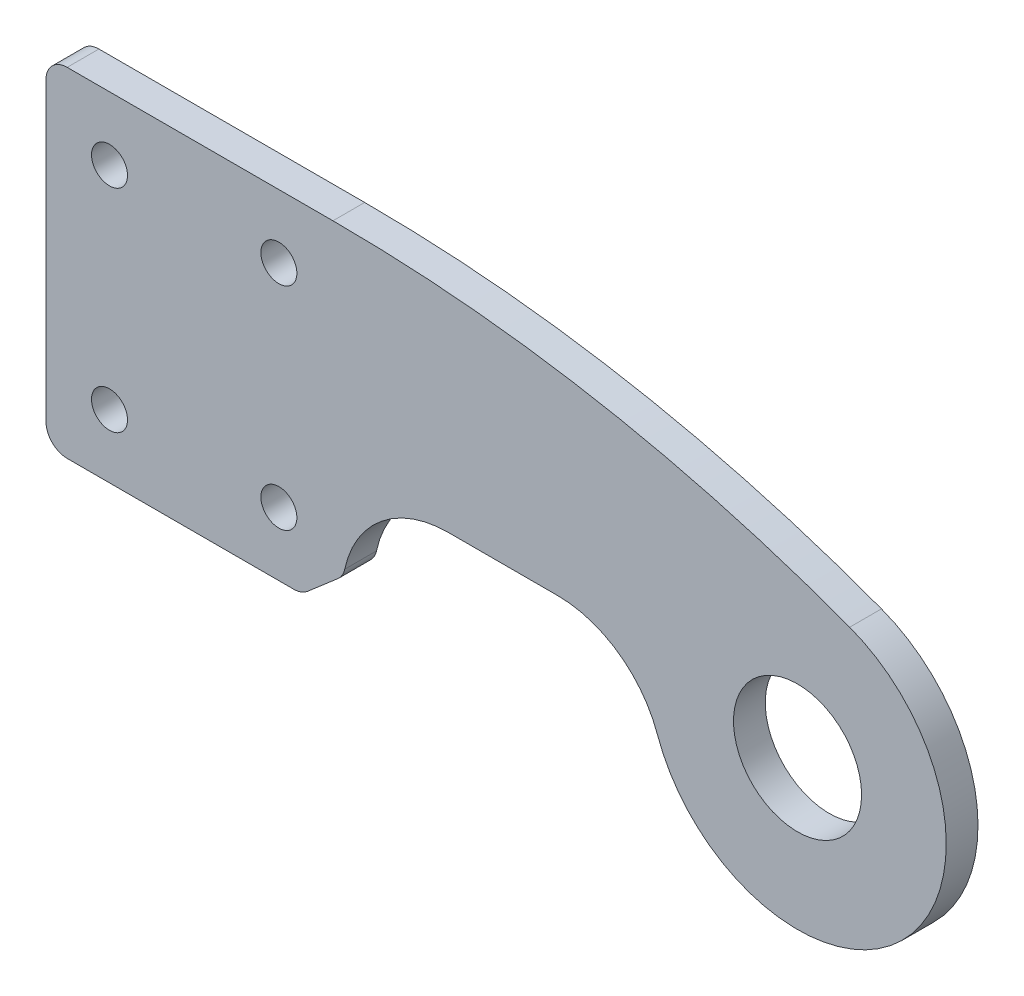
ISO-10303-21;
HEADER;
FILE_DESCRIPTION(('STEP AP214'),'2;1');
FILE_NAME('part.step','',(''),(''),'','','');
FILE_SCHEMA(('AUTOMOTIVE_DESIGN { 1 0 10303 214 1 1 1 1 }'));
ENDSEC;
DATA;
#1=APPLICATION_CONTEXT('core data for automotive mechanical design processes');
#2=APPLICATION_PROTOCOL_DEFINITION('international standard','automotive_design',2000,#1);
#3=PRODUCT_CONTEXT('',#1,'mechanical');
#4=PRODUCT('Part','Part','',(#3));
#5=PRODUCT_RELATED_PRODUCT_CATEGORY('part','',(#4));
#6=PRODUCT_DEFINITION_FORMATION('','',#4);
#7=PRODUCT_DEFINITION_CONTEXT('part definition',#1,'design');
#8=PRODUCT_DEFINITION('design','',#6,#7);
#9=PRODUCT_DEFINITION_SHAPE('','',#8);
#10=(LENGTH_UNIT() NAMED_UNIT(*) SI_UNIT(.MILLI.,.METRE.));
#11=(NAMED_UNIT(*) PLANE_ANGLE_UNIT() SI_UNIT($,.RADIAN.));
#12=(NAMED_UNIT(*) SI_UNIT($,.STERADIAN.) SOLID_ANGLE_UNIT());
#13=UNCERTAINTY_MEASURE_WITH_UNIT(LENGTH_MEASURE(1.E-05),#10,'distance_accuracy_value','');
#14=(GEOMETRIC_REPRESENTATION_CONTEXT(3) GLOBAL_UNCERTAINTY_ASSIGNED_CONTEXT((#13)) GLOBAL_UNIT_ASSIGNED_CONTEXT((#10,
#11,#12)) REPRESENTATION_CONTEXT('',''));
#15=CARTESIAN_POINT('',(0.,0.,0.));
#16=DIRECTION('',(0.,0.,1.));
#17=DIRECTION('',(1.,0.,0.));
#18=AXIS2_PLACEMENT_3D('',#15,#16,#17);
#19=CARTESIAN_POINT('',(0.,0.,0.75));
#20=DIRECTION('',(0.,0.,1.));
#21=DIRECTION('',(1.,0.,0.));
#22=AXIS2_PLACEMENT_3D('',#19,#20,#21);
#23=PLANE('',#22);
#24=CARTESIAN_POINT('',(0.,0.,0.75));
#25=DIRECTION('',(0.,0.,1.));
#26=DIRECTION('',(1.,0.,0.));
#27=AXIS2_PLACEMENT_3D('',#24,#25,#26);
#28=CIRCLE('',#27,7.025);
#29=CARTESIAN_POINT('',(-6.61978303243992,-2.35140332640333,0.75));
#30=VERTEX_POINT('',#29);
#31=CARTESIAN_POINT('',(2.46403607621132,6.57868917149374,0.75));
#32=VERTEX_POINT('',#31);
#33=EDGE_CURVE('E148',#30,#32,#28,.T.);
#34=ORIENTED_EDGE('',*,*,#33,.T.);
#35=CARTESIAN_POINT('',(-21.9455652369475,-58.5921017068076,0.75));
#36=DIRECTION('',(0.,0.,1.));
#37=DIRECTION('',(-1.,0.,0.));
#38=AXIS2_PLACEMENT_3D('',#35,#36,#37);
#39=CIRCLE('',#38,69.5921017068076);
#40=CARTESIAN_POINT('',(-21.9455652369475,11.,0.75));
#41=VERTEX_POINT('',#40);
#42=EDGE_CURVE('E132',#32,#41,#39,.T.);
#43=ORIENTED_EDGE('',*,*,#42,.T.);
#44=DIRECTION('',(-1.,0.,0.));
#45=VECTOR('',#44,1.);
#46=CARTESIAN_POINT('',(-35.5,11.,0.75));
#47=LINE('',#46,#45);
#48=CARTESIAN_POINT('',(-34.5,11.,0.75));
#49=VERTEX_POINT('',#48);
#50=EDGE_CURVE('E140',#41,#49,#47,.T.);
#51=ORIENTED_EDGE('',*,*,#50,.T.);
#52=CARTESIAN_POINT('',(-34.5,10.,0.75));
#53=DIRECTION('',(0.,0.,1.));
#54=DIRECTION('',(1.,0.,0.));
#55=AXIS2_PLACEMENT_3D('',#52,#53,#54);
#56=CIRCLE('',#55,1.);
#57=CARTESIAN_POINT('',(-35.5,10.,0.75));
#58=VERTEX_POINT('',#57);
#59=EDGE_CURVE('E203',#49,#58,#56,.T.);
#60=ORIENTED_EDGE('',*,*,#59,.T.);
#61=DIRECTION('',(0.,-1.,0.));
#62=VECTOR('',#61,1.);
#63=CARTESIAN_POINT('',(-35.5,11.,0.75));
#64=LINE('',#63,#62);
#65=CARTESIAN_POINT('',(-35.5,-4.,0.75));
#66=VERTEX_POINT('',#65);
#67=EDGE_CURVE('E173',#58,#66,#64,.T.);
#68=ORIENTED_EDGE('',*,*,#67,.T.);
#69=CARTESIAN_POINT('',(-34.5,-4.,0.75));
#70=DIRECTION('',(0.,0.,1.));
#71=DIRECTION('',(1.,0.,0.));
#72=AXIS2_PLACEMENT_3D('',#69,#70,#71);
#73=CIRCLE('',#72,1.);
#74=CARTESIAN_POINT('',(-34.5,-5.,0.75));
#75=VERTEX_POINT('',#74);
#76=EDGE_CURVE('E205',#66,#75,#73,.T.);
#77=ORIENTED_EDGE('',*,*,#76,.T.);
#78=DIRECTION('',(1.,0.,0.));
#79=VECTOR('',#78,1.);
#80=CARTESIAN_POINT('',(-35.5,-5.,0.75));
#81=LINE('',#80,#79);
#82=CARTESIAN_POINT('',(-23.796345988965,-5.,0.75));
#83=VERTEX_POINT('',#82);
#84=EDGE_CURVE('E245',#75,#83,#81,.T.);
#85=ORIENTED_EDGE('',*,*,#84,.T.);
#86=CARTESIAN_POINT('',(-23.796345988965,-4.,0.75));
#87=DIRECTION('',(0.,0.,1.));
#88=DIRECTION('',(1.,0.,0.));
#89=AXIS2_PLACEMENT_3D('',#86,#87,#88);
#90=CIRCLE('',#89,1.);
#91=CARTESIAN_POINT('',(-23.1430576037279,-4.7571091636708,0.75));
#92=VERTEX_POINT('',#91);
#93=EDGE_CURVE('E47',#83,#92,#90,.T.);
#94=ORIENTED_EDGE('',*,*,#93,.T.);
#95=DIRECTION('',(0.757109163670796,0.653288385237109,0.));
#96=VECTOR('',#95,1.);
#97=CARTESIAN_POINT('',(-7.52420964312233,8.71995920778616,0.75));
#98=LINE('',#97,#96);
#99=CARTESIAN_POINT('',(-21.7131765941958,-3.52330471297653,0.75));
#100=VERTEX_POINT('',#99);
#101=EDGE_CURVE('E211',#92,#100,#98,.T.);
#102=ORIENTED_EDGE('',*,*,#101,.T.);
#103=CARTESIAN_POINT('',(-22.3664649794329,-2.76619554930574,0.75));
#104=DIRECTION('',(0.,0.,1.));
#105=DIRECTION('',(1.,0.,0.));
#106=AXIS2_PLACEMENT_3D('',#103,#104,#105);
#107=CIRCLE('',#106,1.);
#108=CARTESIAN_POINT('',(-21.3887208161941,-2.97599629108811,0.75));
#109=VERTEX_POINT('',#108);
#110=EDGE_CURVE('E40',#100,#109,#107,.T.);
#111=ORIENTED_EDGE('',*,*,#110,.T.);
#112=CARTESIAN_POINT('',(-16.5,-4.025,0.75));
#113=DIRECTION('',(0.,0.,1.));
#114=DIRECTION('',(1.,0.,0.));
#115=AXIS2_PLACEMENT_3D('',#112,#113,#114);
#116=CIRCLE('',#115,5.);
#117=CARTESIAN_POINT('',(-16.5,0.975000000000004,0.75));
#118=VERTEX_POINT('',#117);
#119=EDGE_CURVE('E189',#109,#118,#116,.F.);
#120=ORIENTED_EDGE('',*,*,#119,.T.);
#121=DIRECTION('',(1.,0.,0.));
#122=VECTOR('',#121,1.);
#123=CARTESIAN_POINT('',(-21.5,0.975000000000006,0.75));
#124=LINE('',#123,#122);
#125=CARTESIAN_POINT('',(-11.3313723793722,0.975000000000002,0.75));
#126=VERTEX_POINT('',#125);
#127=EDGE_CURVE('E155',#118,#126,#124,.T.);
#128=ORIENTED_EDGE('',*,*,#127,.T.);
#129=CARTESIAN_POINT('',(-11.3313723793722,-4.025,0.75));
#130=DIRECTION('',(0.,0.,1.));
#131=DIRECTION('',(1.,0.,0.));
#132=AXIS2_PLACEMENT_3D('',#129,#130,#131);
#133=CIRCLE('',#132,5.);
#134=EDGE_CURVE('E184',#126,#30,#133,.F.);
#135=ORIENTED_EDGE('',*,*,#134,.T.);
#136=EDGE_LOOP('',(#34,#43,#51,#60,#68,#77,#85,#94,#102,#111,#120,#128,#135));
#137=FACE_BOUND('',#136,.T.);
#138=CARTESIAN_POINT('',(-24.5,-2.,0.75));
#139=DIRECTION('',(0.,0.,1.));
#140=DIRECTION('',(1.,0.,0.));
#141=AXIS2_PLACEMENT_3D('',#138,#139,#140);
#142=CIRCLE('',#141,0.85);
#143=CARTESIAN_POINT('',(-23.65,-2.,0.75));
#144=VERTEX_POINT('',#143);
#145=EDGE_CURVE('E289',#144,#144,#142,.T.);
#146=ORIENTED_EDGE('',*,*,#145,.F.);
#147=EDGE_LOOP('',(#146));
#148=FACE_BOUND('',#147,.T.);
#149=CARTESIAN_POINT('',(-32.5,8.,0.75));
#150=DIRECTION('',(0.,0.,1.));
#151=DIRECTION('',(1.,0.,0.));
#152=AXIS2_PLACEMENT_3D('',#149,#150,#151);
#153=CIRCLE('',#152,0.849999999999999);
#154=CARTESIAN_POINT('',(-31.65,8.,0.75));
#155=VERTEX_POINT('',#154);
#156=EDGE_CURVE('E277',#155,#155,#153,.T.);
#157=ORIENTED_EDGE('',*,*,#156,.F.);
#158=EDGE_LOOP('',(#157));
#159=FACE_BOUND('',#158,.T.);
#160=CARTESIAN_POINT('',(0.,0.,0.75));
#161=DIRECTION('',(0.,0.,1.));
#162=DIRECTION('',(1.,0.,0.));
#163=AXIS2_PLACEMENT_3D('',#160,#161,#162);
#164=CIRCLE('',#163,3.025);
#165=CARTESIAN_POINT('',(3.025,0.,0.75));
#166=VERTEX_POINT('',#165);
#167=EDGE_CURVE('E163',#166,#166,#164,.T.);
#168=ORIENTED_EDGE('',*,*,#167,.F.);
#169=EDGE_LOOP('',(#168));
#170=FACE_BOUND('',#169,.T.);
#171=CARTESIAN_POINT('',(-24.5,8.,0.75));
#172=DIRECTION('',(0.,0.,1.));
#173=DIRECTION('',(1.,0.,0.));
#174=AXIS2_PLACEMENT_3D('',#171,#172,#173);
#175=CIRCLE('',#174,0.85);
#176=CARTESIAN_POINT('',(-23.65,8.,0.75));
#177=VERTEX_POINT('',#176);
#178=EDGE_CURVE('E283',#177,#177,#175,.T.);
#179=ORIENTED_EDGE('',*,*,#178,.F.);
#180=EDGE_LOOP('',(#179));
#181=FACE_BOUND('',#180,.T.);
#182=CARTESIAN_POINT('',(-32.5,-2.,0.75));
#183=DIRECTION('',(0.,0.,1.));
#184=DIRECTION('',(1.,0.,0.));
#185=AXIS2_PLACEMENT_3D('',#182,#183,#184);
#186=CIRCLE('',#185,0.85);
#187=CARTESIAN_POINT('',(-31.65,-2.,0.75));
#188=VERTEX_POINT('',#187);
#189=EDGE_CURVE('E295',#188,#188,#186,.T.);
#190=ORIENTED_EDGE('',*,*,#189,.F.);
#191=EDGE_LOOP('',(#190));
#192=FACE_BOUND('',#191,.T.);
#193=ADVANCED_FACE('F32',(#137,#148,#159,#170,#181,#192),#23,.T.);
#194=CARTESIAN_POINT('',(0.,0.,-0.75));
#195=DIRECTION('',(0.,0.,1.));
#196=DIRECTION('',(1.,0.,0.));
#197=AXIS2_PLACEMENT_3D('',#194,#195,#196);
#198=PLANE('',#197);
#199=CARTESIAN_POINT('',(-24.5,-2.,-0.75));
#200=DIRECTION('',(0.,0.,1.));
#201=DIRECTION('',(1.,0.,0.));
#202=AXIS2_PLACEMENT_3D('',#199,#200,#201);
#203=CIRCLE('',#202,0.85);
#204=CARTESIAN_POINT('',(-23.65,-2.,-0.75));
#205=VERTEX_POINT('',#204);
#206=EDGE_CURVE('E292',#205,#205,#203,.T.);
#207=ORIENTED_EDGE('',*,*,#206,.T.);
#208=EDGE_LOOP('',(#207));
#209=FACE_BOUND('',#208,.T.);
#210=CARTESIAN_POINT('',(-32.5,8.,-0.75));
#211=DIRECTION('',(0.,0.,1.));
#212=DIRECTION('',(1.,0.,0.));
#213=AXIS2_PLACEMENT_3D('',#210,#211,#212);
#214=CIRCLE('',#213,0.849999999999999);
#215=CARTESIAN_POINT('',(-31.65,8.,-0.75));
#216=VERTEX_POINT('',#215);
#217=EDGE_CURVE('E280',#216,#216,#214,.T.);
#218=ORIENTED_EDGE('',*,*,#217,.T.);
#219=EDGE_LOOP('',(#218));
#220=FACE_BOUND('',#219,.T.);
#221=DIRECTION('',(-1.,0.,0.));
#222=VECTOR('',#221,1.);
#223=CARTESIAN_POINT('',(-35.5,11.,-0.75));
#224=LINE('',#223,#222);
#225=CARTESIAN_POINT('',(-21.9455652369475,11.,-0.750000000000001));
#226=VERTEX_POINT('',#225);
#227=CARTESIAN_POINT('',(-34.5,11.,-0.75));
#228=VERTEX_POINT('',#227);
#229=EDGE_CURVE('E172',#226,#228,#224,.T.);
#230=ORIENTED_EDGE('',*,*,#229,.F.);
#231=CARTESIAN_POINT('',(-21.9455652369475,-58.5921017068076,-0.750000000000001));
#232=DIRECTION('',(0.,0.,1.));
#233=DIRECTION('',(1.,0.,0.));
#234=AXIS2_PLACEMENT_3D('',#231,#232,#233);
#235=CIRCLE('',#234,69.5921017068076);
#236=CARTESIAN_POINT('',(2.46403607621132,6.57868917149374,-0.750000000000001));
#237=VERTEX_POINT('',#236);
#238=EDGE_CURVE('E134',#226,#237,#235,.F.);
#239=ORIENTED_EDGE('',*,*,#238,.T.);
#240=CARTESIAN_POINT('',(0.,0.,-0.75));
#241=DIRECTION('',(0.,0.,1.));
#242=DIRECTION('',(1.,0.,0.));
#243=AXIS2_PLACEMENT_3D('',#240,#241,#242);
#244=CIRCLE('',#243,7.025);
#245=CARTESIAN_POINT('',(-6.61978303243992,-2.35140332640333,-0.75));
#246=VERTEX_POINT('',#245);
#247=EDGE_CURVE('E169',#246,#237,#244,.T.);
#248=ORIENTED_EDGE('',*,*,#247,.F.);
#249=CARTESIAN_POINT('',(-11.3313723793722,-4.025,-0.75));
#250=DIRECTION('',(0.,0.,1.));
#251=DIRECTION('',(1.,0.,0.));
#252=AXIS2_PLACEMENT_3D('',#249,#250,#251);
#253=CIRCLE('',#252,5.);
#254=CARTESIAN_POINT('',(-11.3313723793722,0.975000000000002,-0.75));
#255=VERTEX_POINT('',#254);
#256=EDGE_CURVE('E182',#246,#255,#253,.T.);
#257=ORIENTED_EDGE('',*,*,#256,.T.);
#258=DIRECTION('',(1.,0.,0.));
#259=VECTOR('',#258,1.);
#260=CARTESIAN_POINT('',(-21.5,0.975000000000006,-0.75));
#261=LINE('',#260,#259);
#262=CARTESIAN_POINT('',(-16.5,0.975000000000004,-0.75));
#263=VERTEX_POINT('',#262);
#264=EDGE_CURVE('E166',#263,#255,#261,.T.);
#265=ORIENTED_EDGE('',*,*,#264,.F.);
#266=CARTESIAN_POINT('',(-16.5,-4.025,-0.75));
#267=DIRECTION('',(0.,0.,1.));
#268=DIRECTION('',(1.,0.,0.));
#269=AXIS2_PLACEMENT_3D('',#266,#267,#268);
#270=CIRCLE('',#269,5.);
#271=CARTESIAN_POINT('',(-21.3887208161941,-2.97599629108811,-0.75));
#272=VERTEX_POINT('',#271);
#273=EDGE_CURVE('E186',#263,#272,#270,.T.);
#274=ORIENTED_EDGE('',*,*,#273,.T.);
#275=CARTESIAN_POINT('',(-22.3664649794329,-2.76619554930574,-0.75));
#276=DIRECTION('',(0.,0.,1.));
#277=DIRECTION('',(1.,0.,0.));
#278=AXIS2_PLACEMENT_3D('',#275,#276,#277);
#279=CIRCLE('',#278,1.);
#280=CARTESIAN_POINT('',(-21.7131765941958,-3.52330471297653,-0.75));
#281=VERTEX_POINT('',#280);
#282=EDGE_CURVE('E218',#272,#281,#279,.F.);
#283=ORIENTED_EDGE('',*,*,#282,.T.);
#284=DIRECTION('',(-0.757109163670796,-0.653288385237109,0.));
#285=VECTOR('',#284,1.);
#286=CARTESIAN_POINT('',(-21.4461062298271,-3.29285714285712,-0.75));
#287=LINE('',#286,#285);
#288=CARTESIAN_POINT('',(-23.1430576037279,-4.7571091636708,-0.75));
#289=VERTEX_POINT('',#288);
#290=EDGE_CURVE('E208',#281,#289,#287,.T.);
#291=ORIENTED_EDGE('',*,*,#290,.T.);
#292=CARTESIAN_POINT('',(-23.796345988965,-4.,-0.75));
#293=DIRECTION('',(0.,0.,1.));
#294=DIRECTION('',(1.,0.,0.));
#295=AXIS2_PLACEMENT_3D('',#292,#293,#294);
#296=CIRCLE('',#295,1.);
#297=CARTESIAN_POINT('',(-23.796345988965,-5.,-0.75));
#298=VERTEX_POINT('',#297);
#299=EDGE_CURVE('E216',#289,#298,#296,.F.);
#300=ORIENTED_EDGE('',*,*,#299,.T.);
#301=DIRECTION('',(1.,0.,0.));
#302=VECTOR('',#301,1.);
#303=CARTESIAN_POINT('',(-35.5,-5.,-0.75));
#304=LINE('',#303,#302);
#305=CARTESIAN_POINT('',(-34.5,-5.,-0.75));
#306=VERTEX_POINT('',#305);
#307=EDGE_CURVE('E162',#306,#298,#304,.T.);
#308=ORIENTED_EDGE('',*,*,#307,.F.);
#309=CARTESIAN_POINT('',(-34.5,-4.,-0.75));
#310=DIRECTION('',(0.,0.,1.));
#311=DIRECTION('',(1.,0.,0.));
#312=AXIS2_PLACEMENT_3D('',#309,#310,#311);
#313=CIRCLE('',#312,1.);
#314=CARTESIAN_POINT('',(-35.5,-4.,-0.75));
#315=VERTEX_POINT('',#314);
#316=EDGE_CURVE('E196',#306,#315,#313,.F.);
#317=ORIENTED_EDGE('',*,*,#316,.T.);
#318=DIRECTION('',(0.,-1.,0.));
#319=VECTOR('',#318,1.);
#320=CARTESIAN_POINT('',(-35.5,11.,-0.75));
#321=LINE('',#320,#319);
#322=CARTESIAN_POINT('',(-35.5,10.,-0.75));
#323=VERTEX_POINT('',#322);
#324=EDGE_CURVE('E159',#323,#315,#321,.T.);
#325=ORIENTED_EDGE('',*,*,#324,.F.);
#326=CARTESIAN_POINT('',(-34.5,10.,-0.75));
#327=DIRECTION('',(0.,0.,1.));
#328=DIRECTION('',(1.,0.,0.));
#329=AXIS2_PLACEMENT_3D('',#326,#327,#328);
#330=CIRCLE('',#329,1.);
#331=EDGE_CURVE('E194',#323,#228,#330,.F.);
#332=ORIENTED_EDGE('',*,*,#331,.T.);
#333=EDGE_LOOP('',(#230,#239,#248,#257,#265,#274,#283,#291,#300,#308,#317,#325,#332));
#334=FACE_BOUND('',#333,.T.);
#335=CARTESIAN_POINT('',(0.,0.,-0.75));
#336=DIRECTION('',(0.,0.,1.));
#337=DIRECTION('',(1.,0.,0.));
#338=AXIS2_PLACEMENT_3D('',#335,#336,#337);
#339=CIRCLE('',#338,3.025);
#340=CARTESIAN_POINT('',(3.025,0.,-0.75));
#341=VERTEX_POINT('',#340);
#342=EDGE_CURVE('E274',#341,#341,#339,.T.);
#343=ORIENTED_EDGE('',*,*,#342,.T.);
#344=EDGE_LOOP('',(#343));
#345=FACE_BOUND('',#344,.T.);
#346=CARTESIAN_POINT('',(-24.5,8.,-0.75));
#347=DIRECTION('',(0.,0.,1.));
#348=DIRECTION('',(1.,0.,0.));
#349=AXIS2_PLACEMENT_3D('',#346,#347,#348);
#350=CIRCLE('',#349,0.85);
#351=CARTESIAN_POINT('',(-23.65,8.,-0.75));
#352=VERTEX_POINT('',#351);
#353=EDGE_CURVE('E286',#352,#352,#350,.T.);
#354=ORIENTED_EDGE('',*,*,#353,.T.);
#355=EDGE_LOOP('',(#354));
#356=FACE_BOUND('',#355,.T.);
#357=CARTESIAN_POINT('',(-32.5,-2.,-0.75));
#358=DIRECTION('',(0.,0.,1.));
#359=DIRECTION('',(1.,0.,0.));
#360=AXIS2_PLACEMENT_3D('',#357,#358,#359);
#361=CIRCLE('',#360,0.85);
#362=CARTESIAN_POINT('',(-31.65,-2.,-0.75));
#363=VERTEX_POINT('',#362);
#364=EDGE_CURVE('E259',#363,#363,#361,.T.);
#365=ORIENTED_EDGE('',*,*,#364,.T.);
#366=EDGE_LOOP('',(#365));
#367=FACE_BOUND('',#366,.T.);
#368=ADVANCED_FACE('F234',(#209,#220,#334,#345,#356,#367),#198,.F.);
#369=CARTESIAN_POINT('',(-35.5,11.,0.75));
#370=DIRECTION('',(1.,0.,0.));
#371=DIRECTION('',(0.,0.,-1.));
#372=AXIS2_PLACEMENT_3D('',#369,#370,#371);
#373=PLANE('',#372);
#374=ORIENTED_EDGE('',*,*,#324,.T.);
#375=DIRECTION('',(0.,0.,-1.));
#376=VECTOR('',#375,1.);
#377=CARTESIAN_POINT('',(-35.5,-4.,0.75));
#378=LINE('',#377,#376);
#379=EDGE_CURVE('E201',#315,#66,#378,.F.);
#380=ORIENTED_EDGE('',*,*,#379,.T.);
#381=ORIENTED_EDGE('',*,*,#67,.F.);
#382=DIRECTION('',(0.,0.,-1.));
#383=VECTOR('',#382,1.);
#384=CARTESIAN_POINT('',(-35.5,10.,0.75));
#385=LINE('',#384,#383);
#386=EDGE_CURVE('E198',#58,#323,#385,.T.);
#387=ORIENTED_EDGE('',*,*,#386,.T.);
#388=EDGE_LOOP('',(#374,#380,#381,#387));
#389=FACE_BOUND('',#388,.T.);
#390=ADVANCED_FACE('F252',(#389),#373,.F.);
#391=CARTESIAN_POINT('',(-35.5,-5.,0.75));
#392=DIRECTION('',(0.,1.,0.));
#393=DIRECTION('',(0.,0.,1.));
#394=AXIS2_PLACEMENT_3D('',#391,#392,#393);
#395=PLANE('',#394);
#396=ORIENTED_EDGE('',*,*,#307,.T.);
#397=DIRECTION('',(0.,0.,1.));
#398=VECTOR('',#397,1.);
#399=CARTESIAN_POINT('',(-23.796345988965,-5.,0.75));
#400=LINE('',#399,#398);
#401=EDGE_CURVE('E11',#298,#83,#400,.T.);
#402=ORIENTED_EDGE('',*,*,#401,.T.);
#403=ORIENTED_EDGE('',*,*,#84,.F.);
#404=DIRECTION('',(0.,0.,-1.));
#405=VECTOR('',#404,1.);
#406=CARTESIAN_POINT('',(-34.5,-5.,0.75));
#407=LINE('',#406,#405);
#408=EDGE_CURVE('E191',#75,#306,#407,.T.);
#409=ORIENTED_EDGE('',*,*,#408,.T.);
#410=EDGE_LOOP('',(#396,#402,#403,#409));
#411=FACE_BOUND('',#410,.T.);
#412=ADVANCED_FACE('F241',(#411),#395,.F.);
#413=CARTESIAN_POINT('',(-21.5,0.975000000000006,0.75));
#414=DIRECTION('',(0.,1.,0.));
#415=DIRECTION('',(-1.,0.,0.));
#416=AXIS2_PLACEMENT_3D('',#413,#414,#415);
#417=PLANE('',#416);
#418=ORIENTED_EDGE('',*,*,#264,.T.);
#419=DIRECTION('',(0.,0.,1.));
#420=VECTOR('',#419,1.);
#421=CARTESIAN_POINT('',(-11.3313723793722,0.975000000000002,0.75));
#422=LINE('',#421,#420);
#423=EDGE_CURVE('E180',#255,#126,#422,.T.);
#424=ORIENTED_EDGE('',*,*,#423,.T.);
#425=ORIENTED_EDGE('',*,*,#127,.F.);
#426=DIRECTION('',(0.,0.,-1.));
#427=VECTOR('',#426,1.);
#428=CARTESIAN_POINT('',(-16.5,0.975000000000004,-0.75));
#429=LINE('',#428,#427);
#430=EDGE_CURVE('E177',#118,#263,#429,.T.);
#431=ORIENTED_EDGE('',*,*,#430,.T.);
#432=EDGE_LOOP('',(#418,#424,#425,#431));
#433=FACE_BOUND('',#432,.T.);
#434=ADVANCED_FACE('F270',(#433),#417,.F.);
#435=CARTESIAN_POINT('',(0.,0.,0.75));
#436=DIRECTION('',(0.,0.,-1.));
#437=DIRECTION('',(-1.,0.,0.));
#438=AXIS2_PLACEMENT_3D('',#435,#436,#437);
#439=CYLINDRICAL_SURFACE('',#438,7.025);
#440=ORIENTED_EDGE('',*,*,#247,.T.);
#441=DIRECTION('',(0.,0.,1.));
#442=VECTOR('',#441,1.);
#443=CARTESIAN_POINT('',(2.46403607621132,6.57868917149374,-25.5567858802714));
#444=LINE('',#443,#442);
#445=EDGE_CURVE('E149',#237,#32,#444,.T.);
#446=ORIENTED_EDGE('',*,*,#445,.T.);
#447=ORIENTED_EDGE('',*,*,#33,.F.);
#448=DIRECTION('',(0.,0.,-1.));
#449=VECTOR('',#448,1.);
#450=CARTESIAN_POINT('',(-6.61978303243992,-2.35140332640333,0.75));
#451=LINE('',#450,#449);
#452=EDGE_CURVE('E139',#30,#246,#451,.T.);
#453=ORIENTED_EDGE('',*,*,#452,.T.);
#454=EDGE_LOOP('',(#440,#446,#447,#453));
#455=FACE_BOUND('',#454,.T.);
#456=ADVANCED_FACE('F263',(#455),#439,.T.);
#457=CARTESIAN_POINT('',(-35.5,11.,0.75));
#458=DIRECTION('',(0.,-1.,0.));
#459=DIRECTION('',(0.,0.,-1.));
#460=AXIS2_PLACEMENT_3D('',#457,#458,#459);
#461=PLANE('',#460);
#462=ORIENTED_EDGE('',*,*,#229,.T.);
#463=DIRECTION('',(0.,0.,-1.));
#464=VECTOR('',#463,1.);
#465=CARTESIAN_POINT('',(-34.5,11.,0.75));
#466=LINE('',#465,#464);
#467=EDGE_CURVE('E153',#228,#49,#466,.F.);
#468=ORIENTED_EDGE('',*,*,#467,.T.);
#469=ORIENTED_EDGE('',*,*,#50,.F.);
#470=DIRECTION('',(0.,0.,-1.));
#471=VECTOR('',#470,1.);
#472=CARTESIAN_POINT('',(-21.9455652369475,11.,0.75));
#473=LINE('',#472,#471);
#474=EDGE_CURVE('E128',#41,#226,#473,.T.);
#475=ORIENTED_EDGE('',*,*,#474,.T.);
#476=EDGE_LOOP('',(#462,#468,#469,#475));
#477=FACE_BOUND('',#476,.T.);
#478=ADVANCED_FACE('F151',(#477),#461,.F.);
#479=CARTESIAN_POINT('',(0.,0.,0.75));
#480=DIRECTION('',(0.,0.,-1.));
#481=DIRECTION('',(-1.,0.,0.));
#482=AXIS2_PLACEMENT_3D('',#479,#480,#481);
#483=CYLINDRICAL_SURFACE('',#482,3.025);
#484=ORIENTED_EDGE('',*,*,#167,.T.);
#485=EDGE_LOOP('',(#484));
#486=FACE_BOUND('',#485,.T.);
#487=ORIENTED_EDGE('',*,*,#342,.F.);
#488=EDGE_LOOP('',(#487));
#489=FACE_BOUND('',#488,.T.);
#490=ADVANCED_FACE('F314',(#486,#489),#483,.F.);
#491=CARTESIAN_POINT('',(-32.5,8.,0.75));
#492=DIRECTION('',(0.,0.,-1.));
#493=DIRECTION('',(-1.,0.,0.));
#494=AXIS2_PLACEMENT_3D('',#491,#492,#493);
#495=CYLINDRICAL_SURFACE('',#494,0.849999999999999);
#496=ORIENTED_EDGE('',*,*,#156,.T.);
#497=EDGE_LOOP('',(#496));
#498=FACE_BOUND('',#497,.T.);
#499=ORIENTED_EDGE('',*,*,#217,.F.);
#500=EDGE_LOOP('',(#499));
#501=FACE_BOUND('',#500,.T.);
#502=ADVANCED_FACE('F355',(#498,#501),#495,.F.);
#503=CARTESIAN_POINT('',(-24.5,8.,0.75));
#504=DIRECTION('',(0.,0.,-1.));
#505=DIRECTION('',(-1.,0.,0.));
#506=AXIS2_PLACEMENT_3D('',#503,#504,#505);
#507=CYLINDRICAL_SURFACE('',#506,0.85);
#508=ORIENTED_EDGE('',*,*,#178,.T.);
#509=EDGE_LOOP('',(#508));
#510=FACE_BOUND('',#509,.T.);
#511=ORIENTED_EDGE('',*,*,#353,.F.);
#512=EDGE_LOOP('',(#511));
#513=FACE_BOUND('',#512,.T.);
#514=ADVANCED_FACE('F352',(#510,#513),#507,.F.);
#515=CARTESIAN_POINT('',(-24.5,-2.,0.75));
#516=DIRECTION('',(0.,0.,-1.));
#517=DIRECTION('',(-1.,0.,0.));
#518=AXIS2_PLACEMENT_3D('',#515,#516,#517);
#519=CYLINDRICAL_SURFACE('',#518,0.85);
#520=ORIENTED_EDGE('',*,*,#145,.T.);
#521=EDGE_LOOP('',(#520));
#522=FACE_BOUND('',#521,.T.);
#523=ORIENTED_EDGE('',*,*,#206,.F.);
#524=EDGE_LOOP('',(#523));
#525=FACE_BOUND('',#524,.T.);
#526=ADVANCED_FACE('F349',(#522,#525),#519,.F.);
#527=CARTESIAN_POINT('',(-32.5,-2.,0.75));
#528=DIRECTION('',(0.,0.,-1.));
#529=DIRECTION('',(-1.,0.,0.));
#530=AXIS2_PLACEMENT_3D('',#527,#528,#529);
#531=CYLINDRICAL_SURFACE('',#530,0.85);
#532=ORIENTED_EDGE('',*,*,#189,.T.);
#533=EDGE_LOOP('',(#532));
#534=FACE_BOUND('',#533,.T.);
#535=ORIENTED_EDGE('',*,*,#364,.F.);
#536=EDGE_LOOP('',(#535));
#537=FACE_BOUND('',#536,.T.);
#538=ADVANCED_FACE('F303',(#534,#537),#531,.F.);
#539=CARTESIAN_POINT('',(-11.3313723793722,-4.025,0.75));
#540=DIRECTION('',(0.,0.,-1.));
#541=DIRECTION('',(-1.,0.,0.));
#542=AXIS2_PLACEMENT_3D('',#539,#540,#541);
#543=CYLINDRICAL_SURFACE('',#542,5.);
#544=ORIENTED_EDGE('',*,*,#134,.F.);
#545=ORIENTED_EDGE('',*,*,#423,.F.);
#546=ORIENTED_EDGE('',*,*,#256,.F.);
#547=ORIENTED_EDGE('',*,*,#452,.F.);
#548=EDGE_LOOP('',(#544,#545,#546,#547));
#549=FACE_BOUND('',#548,.T.);
#550=ADVANCED_FACE('F267',(#549),#543,.F.);
#551=CARTESIAN_POINT('',(-16.5,-4.025,0.75));
#552=DIRECTION('',(0.,0.,1.));
#553=DIRECTION('',(1.,0.,0.));
#554=AXIS2_PLACEMENT_3D('',#551,#552,#553);
#555=CYLINDRICAL_SURFACE('',#554,5.);
#556=ORIENTED_EDGE('',*,*,#119,.F.);
#557=DIRECTION('',(0.,0.,1.));
#558=VECTOR('',#557,1.);
#559=CARTESIAN_POINT('',(-21.3887208161941,-2.97599629108811,0.75));
#560=LINE('',#559,#558);
#561=EDGE_CURVE('E213',#109,#272,#560,.F.);
#562=ORIENTED_EDGE('',*,*,#561,.T.);
#563=ORIENTED_EDGE('',*,*,#273,.F.);
#564=ORIENTED_EDGE('',*,*,#430,.F.);
#565=EDGE_LOOP('',(#556,#562,#563,#564));
#566=FACE_BOUND('',#565,.T.);
#567=ADVANCED_FACE('F231',(#566),#555,.F.);
#568=CARTESIAN_POINT('',(-34.5,-4.,0.75));
#569=DIRECTION('',(0.,0.,-1.));
#570=DIRECTION('',(-1.,0.,0.));
#571=AXIS2_PLACEMENT_3D('',#568,#569,#570);
#572=CYLINDRICAL_SURFACE('',#571,1.);
#573=ORIENTED_EDGE('',*,*,#76,.F.);
#574=ORIENTED_EDGE('',*,*,#379,.F.);
#575=ORIENTED_EDGE('',*,*,#316,.F.);
#576=ORIENTED_EDGE('',*,*,#408,.F.);
#577=EDGE_LOOP('',(#573,#574,#575,#576));
#578=FACE_BOUND('',#577,.T.);
#579=ADVANCED_FACE('F248',(#578),#572,.T.);
#580=CARTESIAN_POINT('',(-34.5,10.,0.75));
#581=DIRECTION('',(0.,0.,-1.));
#582=DIRECTION('',(-1.,0.,0.));
#583=AXIS2_PLACEMENT_3D('',#580,#581,#582);
#584=CYLINDRICAL_SURFACE('',#583,1.);
#585=ORIENTED_EDGE('',*,*,#59,.F.);
#586=ORIENTED_EDGE('',*,*,#467,.F.);
#587=ORIENTED_EDGE('',*,*,#331,.F.);
#588=ORIENTED_EDGE('',*,*,#386,.F.);
#589=EDGE_LOOP('',(#585,#586,#587,#588));
#590=FACE_BOUND('',#589,.T.);
#591=ADVANCED_FACE('F257',(#590),#584,.T.);
#592=CARTESIAN_POINT('',(-21.4461062298271,-3.29285714285712,0.75));
#593=DIRECTION('',(0.653288385237109,-0.757109163670795,0.));
#594=DIRECTION('',(0.757109163670796,0.653288385237109,0.));
#595=AXIS2_PLACEMENT_3D('',#592,#593,#594);
#596=PLANE('',#595);
#597=ORIENTED_EDGE('',*,*,#290,.F.);
#598=DIRECTION('',(0.,0.,-1.));
#599=VECTOR('',#598,1.);
#600=CARTESIAN_POINT('',(-21.7131765941958,-3.52330471297653,0.75));
#601=LINE('',#600,#599);
#602=EDGE_CURVE('E54',#281,#100,#601,.F.);
#603=ORIENTED_EDGE('',*,*,#602,.T.);
#604=ORIENTED_EDGE('',*,*,#101,.F.);
#605=DIRECTION('',(0.,0.,1.));
#606=VECTOR('',#605,1.);
#607=CARTESIAN_POINT('',(-23.1430576037279,-4.7571091636708,-0.75));
#608=LINE('',#607,#606);
#609=EDGE_CURVE('E220',#92,#289,#608,.F.);
#610=ORIENTED_EDGE('',*,*,#609,.T.);
#611=EDGE_LOOP('',(#597,#603,#604,#610));
#612=FACE_BOUND('',#611,.T.);
#613=ADVANCED_FACE('F238',(#612),#596,.T.);
#614=CARTESIAN_POINT('',(-22.3664649794329,-2.76619554930574,0.75));
#615=DIRECTION('',(0.,0.,1.));
#616=DIRECTION('',(1.,0.,0.));
#617=AXIS2_PLACEMENT_3D('',#614,#615,#616);
#618=CYLINDRICAL_SURFACE('',#617,1.);
#619=ORIENTED_EDGE('',*,*,#110,.F.);
#620=ORIENTED_EDGE('',*,*,#602,.F.);
#621=ORIENTED_EDGE('',*,*,#282,.F.);
#622=ORIENTED_EDGE('',*,*,#561,.F.);
#623=EDGE_LOOP('',(#619,#620,#621,#622));
#624=FACE_BOUND('',#623,.T.);
#625=ADVANCED_FACE('F232',(#624),#618,.T.);
#626=CARTESIAN_POINT('',(-23.796345988965,-4.,0.75));
#627=DIRECTION('',(0.,0.,-1.));
#628=DIRECTION('',(-1.,0.,0.));
#629=AXIS2_PLACEMENT_3D('',#626,#627,#628);
#630=CYLINDRICAL_SURFACE('',#629,1.);
#631=ORIENTED_EDGE('',*,*,#299,.F.);
#632=ORIENTED_EDGE('',*,*,#609,.F.);
#633=ORIENTED_EDGE('',*,*,#93,.F.);
#634=ORIENTED_EDGE('',*,*,#401,.F.);
#635=EDGE_LOOP('',(#631,#632,#633,#634));
#636=FACE_BOUND('',#635,.T.);
#637=ADVANCED_FACE('F34',(#636),#630,.T.);
#638=CARTESIAN_POINT('',(-21.9455652369475,-58.5921017068076,-25.5567858802714));
#639=DIRECTION('',(0.,0.,1.));
#640=DIRECTION('',(1.,0.,0.));
#641=AXIS2_PLACEMENT_3D('',#638,#639,#640);
#642=CYLINDRICAL_SURFACE('',#641,69.5921017068076);
#643=ORIENTED_EDGE('',*,*,#238,.F.);
#644=ORIENTED_EDGE('',*,*,#474,.F.);
#645=ORIENTED_EDGE('',*,*,#42,.F.);
#646=ORIENTED_EDGE('',*,*,#445,.F.);
#647=EDGE_LOOP('',(#643,#644,#645,#646));
#648=FACE_BOUND('',#647,.T.);
#649=ADVANCED_FACE('F130',(#648),#642,.T.);
#650=CLOSED_SHELL('',(#193,#368,#390,#412,#434,#456,#478,#490,#502,#514,#526,#538,#550,#567,
#579,#591,#613,#625,#637,#649));
#651=MANIFOLD_SOLID_BREP('B2',#650);
#652=ADVANCED_BREP_SHAPE_REPRESENTATION('',(#18,#651),#14);
#653=SHAPE_DEFINITION_REPRESENTATION(#9,#652);
ENDSEC;
END-ISO-10303-21;
